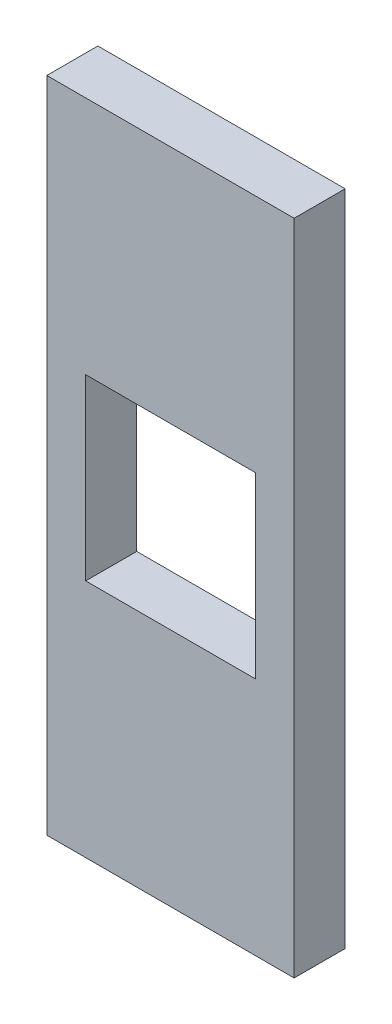
ISO-10303-21;
HEADER;
FILE_DESCRIPTION(('STEP AP214'),'2;1');
FILE_NAME('part.step','',(''),(''),'','','');
FILE_SCHEMA(('AUTOMOTIVE_DESIGN { 1 0 10303 214 1 1 1 1 }'));
ENDSEC;
DATA;
#1=APPLICATION_CONTEXT('core data for automotive mechanical design processes');
#2=APPLICATION_PROTOCOL_DEFINITION('international standard','automotive_design',2000,#1);
#3=PRODUCT_CONTEXT('',#1,'mechanical');
#4=PRODUCT('Part','Part','',(#3));
#5=PRODUCT_RELATED_PRODUCT_CATEGORY('part','',(#4));
#6=PRODUCT_DEFINITION_FORMATION('','',#4);
#7=PRODUCT_DEFINITION_CONTEXT('part definition',#1,'design');
#8=PRODUCT_DEFINITION('design','',#6,#7);
#9=PRODUCT_DEFINITION_SHAPE('','',#8);
#10=(LENGTH_UNIT() NAMED_UNIT(*) SI_UNIT(.MILLI.,.METRE.));
#11=(NAMED_UNIT(*) PLANE_ANGLE_UNIT() SI_UNIT($,.RADIAN.));
#12=(NAMED_UNIT(*) SI_UNIT($,.STERADIAN.) SOLID_ANGLE_UNIT());
#13=UNCERTAINTY_MEASURE_WITH_UNIT(LENGTH_MEASURE(1.E-05),#10,'distance_accuracy_value','');
#14=(GEOMETRIC_REPRESENTATION_CONTEXT(3) GLOBAL_UNCERTAINTY_ASSIGNED_CONTEXT((#13)) GLOBAL_UNIT_ASSIGNED_CONTEXT((#10,
#11,#12)) REPRESENTATION_CONTEXT('',''));
#15=CARTESIAN_POINT('',(0.,0.,0.));
#16=DIRECTION('',(0.,0.,1.));
#17=DIRECTION('',(1.,0.,0.));
#18=AXIS2_PLACEMENT_3D('',#15,#16,#17);
#19=CARTESIAN_POINT('',(0.,0.,5.2));
#20=DIRECTION('',(0.,0.,-1.));
#21=DIRECTION('',(-1.,0.,0.));
#22=AXIS2_PLACEMENT_3D('',#19,#20,#21);
#23=PLANE('',#22);
#24=DIRECTION('',(0.,-1.,0.));
#25=VECTOR('',#24,1.);
#26=CARTESIAN_POINT('',(-0.100000000000003,66.95,5.2));
#27=LINE('',#26,#25);
#28=CARTESIAN_POINT('',(-0.100000000000003,66.95,5.2));
#29=VERTEX_POINT('',#28);
#30=CARTESIAN_POINT('',(-0.0999999999999994,-0.0999999999999925,5.2));
#31=VERTEX_POINT('',#30);
#32=EDGE_CURVE('E134',#29,#31,#27,.T.);
#33=ORIENTED_EDGE('',*,*,#32,.T.);
#34=DIRECTION('',(1.,0.,0.));
#35=VECTOR('',#34,1.);
#36=CARTESIAN_POINT('',(25.1,-0.0999999999999939,5.2));
#37=LINE('',#36,#35);
#38=CARTESIAN_POINT('',(25.1,-0.0999999999999939,5.2));
#39=VERTEX_POINT('',#38);
#40=EDGE_CURVE('E136',#31,#39,#37,.T.);
#41=ORIENTED_EDGE('',*,*,#40,.T.);
#42=DIRECTION('',(0.,1.,0.));
#43=VECTOR('',#42,1.);
#44=CARTESIAN_POINT('',(25.1,22.3,5.2));
#45=LINE('',#44,#43);
#46=CARTESIAN_POINT('',(25.1,66.95,5.2));
#47=VERTEX_POINT('',#46);
#48=EDGE_CURVE('E139',#39,#47,#45,.T.);
#49=ORIENTED_EDGE('',*,*,#48,.T.);
#50=DIRECTION('',(-1.,0.,0.));
#51=VECTOR('',#50,1.);
#52=CARTESIAN_POINT('',(-0.100000000000003,66.95,5.2));
#53=LINE('',#52,#51);
#54=EDGE_CURVE('E141',#47,#29,#53,.T.);
#55=ORIENTED_EDGE('',*,*,#54,.T.);
#56=EDGE_LOOP('',(#33,#41,#49,#55));
#57=FACE_BOUND('',#56,.T.);
#58=DIRECTION('',(-1.,0.,0.));
#59=VECTOR('',#58,1.);
#60=CARTESIAN_POINT('',(3.86,42.525,5.2));
#61=LINE('',#60,#59);
#62=CARTESIAN_POINT('',(21.14,42.525,5.2));
#63=VERTEX_POINT('',#62);
#64=CARTESIAN_POINT('',(3.86,42.525,5.2));
#65=VERTEX_POINT('',#64);
#66=EDGE_CURVE('E98',#63,#65,#61,.T.);
#67=ORIENTED_EDGE('',*,*,#66,.F.);
#68=DIRECTION('',(0.,1.,0.));
#69=VECTOR('',#68,1.);
#70=CARTESIAN_POINT('',(21.14,42.525,5.2));
#71=LINE('',#70,#69);
#72=CARTESIAN_POINT('',(21.14,24.325,5.2));
#73=VERTEX_POINT('',#72);
#74=EDGE_CURVE('E120',#73,#63,#71,.T.);
#75=ORIENTED_EDGE('',*,*,#74,.F.);
#76=DIRECTION('',(1.,0.,0.));
#77=VECTOR('',#76,1.);
#78=CARTESIAN_POINT('',(3.86,24.325,5.2));
#79=LINE('',#78,#77);
#80=CARTESIAN_POINT('',(3.86,24.325,5.2));
#81=VERTEX_POINT('',#80);
#82=EDGE_CURVE('E118',#81,#73,#79,.T.);
#83=ORIENTED_EDGE('',*,*,#82,.F.);
#84=DIRECTION('',(0.,-1.,0.));
#85=VECTOR('',#84,1.);
#86=CARTESIAN_POINT('',(3.86,42.525,5.2));
#87=LINE('',#86,#85);
#88=EDGE_CURVE('E106',#65,#81,#87,.T.);
#89=ORIENTED_EDGE('',*,*,#88,.F.);
#90=EDGE_LOOP('',(#67,#75,#83,#89));
#91=FACE_BOUND('',#90,.T.);
#92=ADVANCED_FACE('F33',(#57,#91),#23,.F.);
#93=CARTESIAN_POINT('',(0.,0.,0.));
#94=DIRECTION('',(0.,0.,-1.));
#95=DIRECTION('',(-1.,0.,0.));
#96=AXIS2_PLACEMENT_3D('',#93,#94,#95);
#97=PLANE('',#96);
#98=DIRECTION('',(0.,-1.,0.));
#99=VECTOR('',#98,1.);
#100=CARTESIAN_POINT('',(-0.0999999999999994,22.3,0.));
#101=LINE('',#100,#99);
#102=CARTESIAN_POINT('',(-0.100000000000003,66.95,0.));
#103=VERTEX_POINT('',#102);
#104=CARTESIAN_POINT('',(-0.0999999999999994,-0.0999999999999925,0.));
#105=VERTEX_POINT('',#104);
#106=EDGE_CURVE('E114',#103,#105,#101,.T.);
#107=ORIENTED_EDGE('',*,*,#106,.F.);
#108=DIRECTION('',(-1.,0.,0.));
#109=VECTOR('',#108,1.);
#110=CARTESIAN_POINT('',(-0.100000000000003,66.95,0.));
#111=LINE('',#110,#109);
#112=CARTESIAN_POINT('',(25.1,66.95,0.));
#113=VERTEX_POINT('',#112);
#114=EDGE_CURVE('E137',#113,#103,#111,.T.);
#115=ORIENTED_EDGE('',*,*,#114,.F.);
#116=DIRECTION('',(0.,1.,0.));
#117=VECTOR('',#116,1.);
#118=CARTESIAN_POINT('',(25.1,66.95,0.));
#119=LINE('',#118,#117);
#120=CARTESIAN_POINT('',(25.1,-0.0999999999999939,0.));
#121=VERTEX_POINT('',#120);
#122=EDGE_CURVE('E148',#121,#113,#119,.T.);
#123=ORIENTED_EDGE('',*,*,#122,.F.);
#124=DIRECTION('',(1.,0.,0.));
#125=VECTOR('',#124,1.);
#126=CARTESIAN_POINT('',(25.1,-0.0999999999999939,0.));
#127=LINE('',#126,#125);
#128=EDGE_CURVE('E145',#105,#121,#127,.T.);
#129=ORIENTED_EDGE('',*,*,#128,.F.);
#130=EDGE_LOOP('',(#107,#115,#123,#129));
#131=FACE_BOUND('',#130,.T.);
#132=DIRECTION('',(0.,1.,0.));
#133=VECTOR('',#132,1.);
#134=CARTESIAN_POINT('',(21.14,42.525,0.));
#135=LINE('',#134,#133);
#136=CARTESIAN_POINT('',(21.14,24.325,0.));
#137=VERTEX_POINT('',#136);
#138=CARTESIAN_POINT('',(21.14,42.525,0.));
#139=VERTEX_POINT('',#138);
#140=EDGE_CURVE('E107',#137,#139,#135,.T.);
#141=ORIENTED_EDGE('',*,*,#140,.T.);
#142=DIRECTION('',(-1.,0.,0.));
#143=VECTOR('',#142,1.);
#144=CARTESIAN_POINT('',(3.86,42.525,0.));
#145=LINE('',#144,#143);
#146=CARTESIAN_POINT('',(3.86,42.525,0.));
#147=VERTEX_POINT('',#146);
#148=EDGE_CURVE('E56',#139,#147,#145,.T.);
#149=ORIENTED_EDGE('',*,*,#148,.T.);
#150=DIRECTION('',(0.,-1.,0.));
#151=VECTOR('',#150,1.);
#152=CARTESIAN_POINT('',(3.86,42.525,0.));
#153=LINE('',#152,#151);
#154=CARTESIAN_POINT('',(3.86,24.325,0.));
#155=VERTEX_POINT('',#154);
#156=EDGE_CURVE('E113',#147,#155,#153,.T.);
#157=ORIENTED_EDGE('',*,*,#156,.T.);
#158=DIRECTION('',(1.,0.,0.));
#159=VECTOR('',#158,1.);
#160=CARTESIAN_POINT('',(3.86,24.325,0.));
#161=LINE('',#160,#159);
#162=EDGE_CURVE('E126',#155,#137,#161,.T.);
#163=ORIENTED_EDGE('',*,*,#162,.T.);
#164=EDGE_LOOP('',(#141,#149,#157,#163));
#165=FACE_BOUND('',#164,.T.);
#166=ADVANCED_FACE('F168',(#131,#165),#97,.T.);
#167=CARTESIAN_POINT('',(-0.0999999999999994,22.3,5.2));
#168=DIRECTION('',(1.,0.,0.));
#169=DIRECTION('',(0.,0.,-1.));
#170=AXIS2_PLACEMENT_3D('',#167,#168,#169);
#171=PLANE('',#170);
#172=ORIENTED_EDGE('',*,*,#106,.T.);
#173=DIRECTION('',(0.,0.,-1.));
#174=VECTOR('',#173,1.);
#175=CARTESIAN_POINT('',(-0.0999999999999994,-0.0999999999999925,5.2));
#176=LINE('',#175,#174);
#177=EDGE_CURVE('E11',#31,#105,#176,.T.);
#178=ORIENTED_EDGE('',*,*,#177,.F.);
#179=ORIENTED_EDGE('',*,*,#32,.F.);
#180=DIRECTION('',(0.,0.,-1.));
#181=VECTOR('',#180,1.);
#182=CARTESIAN_POINT('',(-0.100000000000003,66.95,5.2));
#183=LINE('',#182,#181);
#184=EDGE_CURVE('E143',#29,#103,#183,.T.);
#185=ORIENTED_EDGE('',*,*,#184,.T.);
#186=EDGE_LOOP('',(#172,#178,#179,#185));
#187=FACE_BOUND('',#186,.T.);
#188=ADVANCED_FACE('F35',(#187),#171,.F.);
#189=CARTESIAN_POINT('',(25.1,-0.0999999999999939,5.2));
#190=DIRECTION('',(0.,1.,0.));
#191=DIRECTION('',(-1.,0.,0.));
#192=AXIS2_PLACEMENT_3D('',#189,#190,#191);
#193=PLANE('',#192);
#194=ORIENTED_EDGE('',*,*,#128,.T.);
#195=DIRECTION('',(0.,0.,-1.));
#196=VECTOR('',#195,1.);
#197=CARTESIAN_POINT('',(25.1,-0.0999999999999939,5.2));
#198=LINE('',#197,#196);
#199=EDGE_CURVE('E41',#39,#121,#198,.T.);
#200=ORIENTED_EDGE('',*,*,#199,.F.);
#201=ORIENTED_EDGE('',*,*,#40,.F.);
#202=ORIENTED_EDGE('',*,*,#177,.T.);
#203=EDGE_LOOP('',(#194,#200,#201,#202));
#204=FACE_BOUND('',#203,.T.);
#205=ADVANCED_FACE('F164',(#204),#193,.F.);
#206=CARTESIAN_POINT('',(25.1,66.95,5.2));
#207=DIRECTION('',(-1.,0.,0.));
#208=DIRECTION('',(0.,0.,1.));
#209=AXIS2_PLACEMENT_3D('',#206,#207,#208);
#210=PLANE('',#209);
#211=ORIENTED_EDGE('',*,*,#122,.T.);
#212=DIRECTION('',(0.,0.,-1.));
#213=VECTOR('',#212,1.);
#214=CARTESIAN_POINT('',(25.1,66.95,5.2));
#215=LINE('',#214,#213);
#216=EDGE_CURVE('E154',#47,#113,#215,.T.);
#217=ORIENTED_EDGE('',*,*,#216,.F.);
#218=ORIENTED_EDGE('',*,*,#48,.F.);
#219=ORIENTED_EDGE('',*,*,#199,.T.);
#220=EDGE_LOOP('',(#211,#217,#218,#219));
#221=FACE_BOUND('',#220,.T.);
#222=ADVANCED_FACE('F160',(#221),#210,.F.);
#223=CARTESIAN_POINT('',(-0.100000000000003,66.95,5.2));
#224=DIRECTION('',(0.,-1.,0.));
#225=DIRECTION('',(0.,0.,-1.));
#226=AXIS2_PLACEMENT_3D('',#223,#224,#225);
#227=PLANE('',#226);
#228=ORIENTED_EDGE('',*,*,#114,.T.);
#229=ORIENTED_EDGE('',*,*,#184,.F.);
#230=ORIENTED_EDGE('',*,*,#54,.F.);
#231=ORIENTED_EDGE('',*,*,#216,.T.);
#232=EDGE_LOOP('',(#228,#229,#230,#231));
#233=FACE_BOUND('',#232,.T.);
#234=ADVANCED_FACE('F173',(#233),#227,.F.);
#235=CARTESIAN_POINT('',(3.86,42.525,5.2));
#236=DIRECTION('',(0.,-1.,0.));
#237=DIRECTION('',(0.,0.,-1.));
#238=AXIS2_PLACEMENT_3D('',#235,#236,#237);
#239=PLANE('',#238);
#240=ORIENTED_EDGE('',*,*,#148,.F.);
#241=DIRECTION('',(0.,0.,-1.));
#242=VECTOR('',#241,1.);
#243=CARTESIAN_POINT('',(21.14,42.525,5.2));
#244=LINE('',#243,#242);
#245=EDGE_CURVE('E102',#63,#139,#244,.T.);
#246=ORIENTED_EDGE('',*,*,#245,.F.);
#247=ORIENTED_EDGE('',*,*,#66,.T.);
#248=DIRECTION('',(0.,0.,-1.));
#249=VECTOR('',#248,1.);
#250=CARTESIAN_POINT('',(3.86,42.525,5.2));
#251=LINE('',#250,#249);
#252=EDGE_CURVE('E101',#65,#147,#251,.T.);
#253=ORIENTED_EDGE('',*,*,#252,.T.);
#254=EDGE_LOOP('',(#240,#246,#247,#253));
#255=FACE_BOUND('',#254,.T.);
#256=ADVANCED_FACE('F100',(#255),#239,.T.);
#257=CARTESIAN_POINT('',(3.86,42.525,5.2));
#258=DIRECTION('',(1.,0.,0.));
#259=DIRECTION('',(0.,0.,-1.));
#260=AXIS2_PLACEMENT_3D('',#257,#258,#259);
#261=PLANE('',#260);
#262=ORIENTED_EDGE('',*,*,#156,.F.);
#263=ORIENTED_EDGE('',*,*,#252,.F.);
#264=ORIENTED_EDGE('',*,*,#88,.T.);
#265=DIRECTION('',(0.,0.,-1.));
#266=VECTOR('',#265,1.);
#267=CARTESIAN_POINT('',(3.86,24.325,5.2));
#268=LINE('',#267,#266);
#269=EDGE_CURVE('E115',#81,#155,#268,.T.);
#270=ORIENTED_EDGE('',*,*,#269,.T.);
#271=EDGE_LOOP('',(#262,#263,#264,#270));
#272=FACE_BOUND('',#271,.T.);
#273=ADVANCED_FACE('F110',(#272),#261,.T.);
#274=CARTESIAN_POINT('',(3.86,24.325,5.2));
#275=DIRECTION('',(0.,1.,0.));
#276=DIRECTION('',(0.,0.,1.));
#277=AXIS2_PLACEMENT_3D('',#274,#275,#276);
#278=PLANE('',#277);
#279=ORIENTED_EDGE('',*,*,#162,.F.);
#280=ORIENTED_EDGE('',*,*,#269,.F.);
#281=ORIENTED_EDGE('',*,*,#82,.T.);
#282=DIRECTION('',(0.,0.,-1.));
#283=VECTOR('',#282,1.);
#284=CARTESIAN_POINT('',(21.14,24.325,5.2));
#285=LINE('',#284,#283);
#286=EDGE_CURVE('E48',#73,#137,#285,.T.);
#287=ORIENTED_EDGE('',*,*,#286,.T.);
#288=EDGE_LOOP('',(#279,#280,#281,#287));
#289=FACE_BOUND('',#288,.T.);
#290=ADVANCED_FACE('F260',(#289),#278,.T.);
#291=CARTESIAN_POINT('',(21.14,42.525,5.2));
#292=DIRECTION('',(-1.,0.,0.));
#293=DIRECTION('',(0.,-1.,0.));
#294=AXIS2_PLACEMENT_3D('',#291,#292,#293);
#295=PLANE('',#294);
#296=ORIENTED_EDGE('',*,*,#140,.F.);
#297=ORIENTED_EDGE('',*,*,#286,.F.);
#298=ORIENTED_EDGE('',*,*,#74,.T.);
#299=ORIENTED_EDGE('',*,*,#245,.T.);
#300=EDGE_LOOP('',(#296,#297,#298,#299));
#301=FACE_BOUND('',#300,.T.);
#302=ADVANCED_FACE('F267',(#301),#295,.T.);
#303=CLOSED_SHELL('',(#92,#166,#188,#205,#222,#234,#256,#273,#290,#302));
#304=MANIFOLD_SOLID_BREP('B2',#303);
#305=ADVANCED_BREP_SHAPE_REPRESENTATION('',(#18,#304),#14);
#306=SHAPE_DEFINITION_REPRESENTATION(#9,#305);
ENDSEC;
END-ISO-10303-21;
